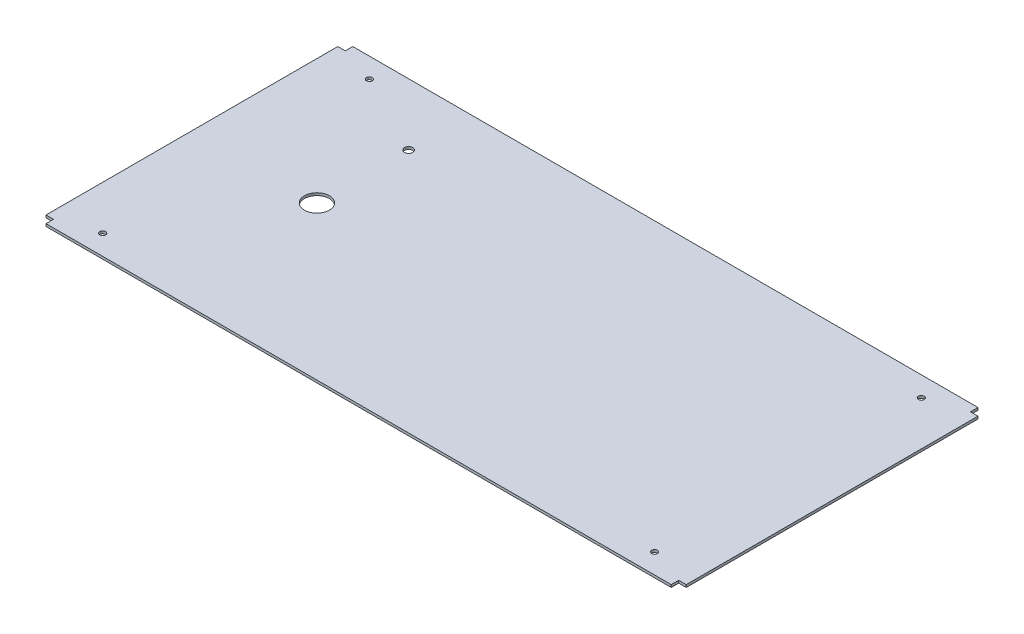
ISO-10303-21;
HEADER;
FILE_DESCRIPTION(('STEP AP214'),'2;1');
FILE_NAME('part.step','',(''),(''),'','','');
FILE_SCHEMA(('AUTOMOTIVE_DESIGN { 1 0 10303 214 1 1 1 1 }'));
ENDSEC;
DATA;
#1=APPLICATION_CONTEXT('core data for automotive mechanical design processes');
#2=APPLICATION_PROTOCOL_DEFINITION('international standard','automotive_design',2000,#1);
#3=PRODUCT_CONTEXT('',#1,'mechanical');
#4=PRODUCT('Part','Part','',(#3));
#5=PRODUCT_RELATED_PRODUCT_CATEGORY('part','',(#4));
#6=PRODUCT_DEFINITION_FORMATION('','',#4);
#7=PRODUCT_DEFINITION_CONTEXT('part definition',#1,'design');
#8=PRODUCT_DEFINITION('design','',#6,#7);
#9=PRODUCT_DEFINITION_SHAPE('','',#8);
#10=(LENGTH_UNIT() NAMED_UNIT(*) SI_UNIT(.MILLI.,.METRE.));
#11=(NAMED_UNIT(*) PLANE_ANGLE_UNIT() SI_UNIT($,.RADIAN.));
#12=(NAMED_UNIT(*) SI_UNIT($,.STERADIAN.) SOLID_ANGLE_UNIT());
#13=UNCERTAINTY_MEASURE_WITH_UNIT(LENGTH_MEASURE(1.E-05),#10,'distance_accuracy_value','');
#14=(GEOMETRIC_REPRESENTATION_CONTEXT(3) GLOBAL_UNCERTAINTY_ASSIGNED_CONTEXT((#13)) GLOBAL_UNIT_ASSIGNED_CONTEXT((#10,
#11,#12)) REPRESENTATION_CONTEXT('',''));
#15=CARTESIAN_POINT('',(0.,0.,0.));
#16=DIRECTION('',(0.,0.,1.));
#17=DIRECTION('',(1.,0.,0.));
#18=AXIS2_PLACEMENT_3D('',#15,#16,#17);
#19=CARTESIAN_POINT('',(0.,3.,0.));
#20=DIRECTION('',(0.,1.,0.));
#21=DIRECTION('',(0.,0.,1.));
#22=AXIS2_PLACEMENT_3D('',#19,#20,#21);
#23=PLANE('',#22);
#24=CARTESIAN_POINT('',(-234.,3.,-110.));
#25=DIRECTION('',(0.,1.,0.));
#26=DIRECTION('',(0.,0.,1.));
#27=AXIS2_PLACEMENT_3D('',#24,#25,#26);
#28=CIRCLE('',#27,5.00000000000002);
#29=CARTESIAN_POINT('',(-234.,3.,-105.));
#30=VERTEX_POINT('',#29);
#31=EDGE_CURVE('E301',#30,#30,#28,.T.);
#32=ORIENTED_EDGE('',*,*,#31,.F.);
#33=EDGE_LOOP('',(#32));
#34=FACE_BOUND('',#33,.T.);
#35=CARTESIAN_POINT('',(-234.,3.,0.));
#36=DIRECTION('',(0.,1.,0.));
#37=DIRECTION('',(0.,0.,1.));
#38=AXIS2_PLACEMENT_3D('',#35,#36,#37);
#39=CIRCLE('',#38,15.);
#40=CARTESIAN_POINT('',(-234.,3.,15.));
#41=VERTEX_POINT('',#40);
#42=EDGE_CURVE('E303',#41,#41,#39,.T.);
#43=ORIENTED_EDGE('',*,*,#42,.F.);
#44=EDGE_LOOP('',(#43));
#45=FACE_BOUND('',#44,.T.);
#46=CARTESIAN_POINT('',(331.06,3.,-160.));
#47=DIRECTION('',(0.,1.,0.));
#48=DIRECTION('',(0.,0.,1.));
#49=AXIS2_PLACEMENT_3D('',#46,#47,#48);
#50=CIRCLE('',#49,3.50000000000002);
#51=CARTESIAN_POINT('',(331.06,3.,-156.5));
#52=VERTEX_POINT('',#51);
#53=EDGE_CURVE('E318',#52,#52,#50,.T.);
#54=ORIENTED_EDGE('',*,*,#53,.F.);
#55=EDGE_LOOP('',(#54));
#56=FACE_BOUND('',#55,.T.);
#57=CARTESIAN_POINT('',(-331.06,3.,-160.));
#58=DIRECTION('',(0.,1.,0.));
#59=DIRECTION('',(0.,0.,1.));
#60=AXIS2_PLACEMENT_3D('',#57,#58,#59);
#61=CIRCLE('',#60,3.50000000000002);
#62=CARTESIAN_POINT('',(-331.06,3.,-156.5));
#63=VERTEX_POINT('',#62);
#64=EDGE_CURVE('E166',#63,#63,#61,.T.);
#65=ORIENTED_EDGE('',*,*,#64,.F.);
#66=EDGE_LOOP('',(#65));
#67=FACE_BOUND('',#66,.T.);
#68=DIRECTION('',(0.,0.,1.));
#69=VECTOR('',#68,1.);
#70=CARTESIAN_POINT('',(-375.,3.,-184.));
#71=LINE('',#70,#69);
#72=CARTESIAN_POINT('',(-375.,3.,-184.));
#73=VERTEX_POINT('',#72);
#74=CARTESIAN_POINT('',(-375.,3.,-175.));
#75=VERTEX_POINT('',#74);
#76=EDGE_CURVE('E185',#73,#75,#71,.T.);
#77=ORIENTED_EDGE('',*,*,#76,.T.);
#78=DIRECTION('',(-1.,0.,0.));
#79=VECTOR('',#78,1.);
#80=CARTESIAN_POINT('',(-384.,3.,-175.));
#81=LINE('',#80,#79);
#82=CARTESIAN_POINT('',(-384.,3.,-175.));
#83=VERTEX_POINT('',#82);
#84=EDGE_CURVE('E113',#75,#83,#81,.T.);
#85=ORIENTED_EDGE('',*,*,#84,.T.);
#86=DIRECTION('',(0.,0.,1.));
#87=VECTOR('',#86,1.);
#88=CARTESIAN_POINT('',(-384.,3.,-175.));
#89=LINE('',#88,#87);
#90=CARTESIAN_POINT('',(-384.,3.,175.));
#91=VERTEX_POINT('',#90);
#92=EDGE_CURVE('E212',#83,#91,#89,.T.);
#93=ORIENTED_EDGE('',*,*,#92,.T.);
#94=DIRECTION('',(1.,0.,0.));
#95=VECTOR('',#94,1.);
#96=CARTESIAN_POINT('',(-384.,3.,175.));
#97=LINE('',#96,#95);
#98=CARTESIAN_POINT('',(-375.,3.,175.));
#99=VERTEX_POINT('',#98);
#100=EDGE_CURVE('E231',#91,#99,#97,.T.);
#101=ORIENTED_EDGE('',*,*,#100,.T.);
#102=DIRECTION('',(0.,0.,1.));
#103=VECTOR('',#102,1.);
#104=CARTESIAN_POINT('',(-375.,3.,184.));
#105=LINE('',#104,#103);
#106=CARTESIAN_POINT('',(-375.,3.,184.));
#107=VERTEX_POINT('',#106);
#108=EDGE_CURVE('E228',#99,#107,#105,.T.);
#109=ORIENTED_EDGE('',*,*,#108,.T.);
#110=DIRECTION('',(1.,0.,0.));
#111=VECTOR('',#110,1.);
#112=CARTESIAN_POINT('',(-375.,3.,184.));
#113=LINE('',#112,#111);
#114=CARTESIAN_POINT('',(375.,3.,184.));
#115=VERTEX_POINT('',#114);
#116=EDGE_CURVE('E230',#107,#115,#113,.T.);
#117=ORIENTED_EDGE('',*,*,#116,.T.);
#118=DIRECTION('',(0.,0.,-1.));
#119=VECTOR('',#118,1.);
#120=CARTESIAN_POINT('',(375.,3.,184.));
#121=LINE('',#120,#119);
#122=CARTESIAN_POINT('',(375.,3.,175.));
#123=VERTEX_POINT('',#122);
#124=EDGE_CURVE('E233',#115,#123,#121,.T.);
#125=ORIENTED_EDGE('',*,*,#124,.T.);
#126=DIRECTION('',(1.,0.,0.));
#127=VECTOR('',#126,1.);
#128=CARTESIAN_POINT('',(384.,3.,175.));
#129=LINE('',#128,#127);
#130=CARTESIAN_POINT('',(384.,3.,175.));
#131=VERTEX_POINT('',#130);
#132=EDGE_CURVE('E239',#123,#131,#129,.T.);
#133=ORIENTED_EDGE('',*,*,#132,.T.);
#134=DIRECTION('',(0.,0.,-1.));
#135=VECTOR('',#134,1.);
#136=CARTESIAN_POINT('',(384.,3.,-175.));
#137=LINE('',#136,#135);
#138=CARTESIAN_POINT('',(384.,3.,-175.));
#139=VERTEX_POINT('',#138);
#140=EDGE_CURVE('E144',#131,#139,#137,.T.);
#141=ORIENTED_EDGE('',*,*,#140,.T.);
#142=DIRECTION('',(-1.,0.,0.));
#143=VECTOR('',#142,1.);
#144=CARTESIAN_POINT('',(384.,3.,-175.));
#145=LINE('',#144,#143);
#146=CARTESIAN_POINT('',(375.,3.,-175.));
#147=VERTEX_POINT('',#146);
#148=EDGE_CURVE('E138',#139,#147,#145,.T.);
#149=ORIENTED_EDGE('',*,*,#148,.T.);
#150=DIRECTION('',(0.,0.,-1.));
#151=VECTOR('',#150,1.);
#152=CARTESIAN_POINT('',(375.,3.,-184.));
#153=LINE('',#152,#151);
#154=CARTESIAN_POINT('',(375.,3.,-184.));
#155=VERTEX_POINT('',#154);
#156=EDGE_CURVE('E142',#147,#155,#153,.T.);
#157=ORIENTED_EDGE('',*,*,#156,.T.);
#158=DIRECTION('',(-1.,0.,0.));
#159=VECTOR('',#158,1.);
#160=CARTESIAN_POINT('',(-375.,3.,-184.));
#161=LINE('',#160,#159);
#162=EDGE_CURVE('E58',#155,#73,#161,.T.);
#163=ORIENTED_EDGE('',*,*,#162,.T.);
#164=EDGE_LOOP('',(#77,#85,#93,#101,#109,#117,#125,#133,#141,#149,#157,#163));
#165=FACE_BOUND('',#164,.T.);
#166=CARTESIAN_POINT('',(-331.06,3.,160.));
#167=DIRECTION('',(0.,1.,0.));
#168=DIRECTION('',(0.,0.,1.));
#169=AXIS2_PLACEMENT_3D('',#166,#167,#168);
#170=CIRCLE('',#169,3.50000000000002);
#171=CARTESIAN_POINT('',(-331.06,3.,163.5));
#172=VERTEX_POINT('',#171);
#173=EDGE_CURVE('E324',#172,#172,#170,.T.);
#174=ORIENTED_EDGE('',*,*,#173,.F.);
#175=EDGE_LOOP('',(#174));
#176=FACE_BOUND('',#175,.T.);
#177=CARTESIAN_POINT('',(331.06,3.,160.));
#178=DIRECTION('',(0.,1.,0.));
#179=DIRECTION('',(0.,0.,1.));
#180=AXIS2_PLACEMENT_3D('',#177,#178,#179);
#181=CIRCLE('',#180,3.50000000000002);
#182=CARTESIAN_POINT('',(331.06,3.,163.5));
#183=VERTEX_POINT('',#182);
#184=EDGE_CURVE('E312',#183,#183,#181,.T.);
#185=ORIENTED_EDGE('',*,*,#184,.F.);
#186=EDGE_LOOP('',(#185));
#187=FACE_BOUND('',#186,.T.);
#188=ADVANCED_FACE('F41',(#34,#45,#56,#67,#165,#176,#187),#23,.T.);
#189=CARTESIAN_POINT('',(0.,0.,0.));
#190=DIRECTION('',(0.,1.,0.));
#191=DIRECTION('',(0.,0.,1.));
#192=AXIS2_PLACEMENT_3D('',#189,#190,#191);
#193=PLANE('',#192);
#194=CARTESIAN_POINT('',(-234.,0.,-110.));
#195=DIRECTION('',(0.,1.,0.));
#196=DIRECTION('',(0.,0.,1.));
#197=AXIS2_PLACEMENT_3D('',#194,#195,#196);
#198=CIRCLE('',#197,5.00000000000002);
#199=CARTESIAN_POINT('',(-234.,0.,-105.));
#200=VERTEX_POINT('',#199);
#201=EDGE_CURVE('E299',#200,#200,#198,.T.);
#202=ORIENTED_EDGE('',*,*,#201,.T.);
#203=EDGE_LOOP('',(#202));
#204=FACE_BOUND('',#203,.T.);
#205=CARTESIAN_POINT('',(-234.,0.,0.));
#206=DIRECTION('',(0.,1.,0.));
#207=DIRECTION('',(0.,0.,1.));
#208=AXIS2_PLACEMENT_3D('',#205,#206,#207);
#209=CIRCLE('',#208,15.);
#210=CARTESIAN_POINT('',(-234.,0.,15.));
#211=VERTEX_POINT('',#210);
#212=EDGE_CURVE('E306',#211,#211,#209,.T.);
#213=ORIENTED_EDGE('',*,*,#212,.T.);
#214=EDGE_LOOP('',(#213));
#215=FACE_BOUND('',#214,.T.);
#216=DIRECTION('',(0.,0.,1.));
#217=VECTOR('',#216,1.);
#218=CARTESIAN_POINT('',(-375.,0.,-184.));
#219=LINE('',#218,#217);
#220=CARTESIAN_POINT('',(-375.,0.,-184.));
#221=VERTEX_POINT('',#220);
#222=CARTESIAN_POINT('',(-375.,0.,-175.));
#223=VERTEX_POINT('',#222);
#224=EDGE_CURVE('E162',#221,#223,#219,.T.);
#225=ORIENTED_EDGE('',*,*,#224,.F.);
#226=DIRECTION('',(-1.,0.,0.));
#227=VECTOR('',#226,1.);
#228=CARTESIAN_POINT('',(-375.,0.,-184.));
#229=LINE('',#228,#227);
#230=CARTESIAN_POINT('',(375.,0.,-184.));
#231=VERTEX_POINT('',#230);
#232=EDGE_CURVE('E105',#231,#221,#229,.T.);
#233=ORIENTED_EDGE('',*,*,#232,.F.);
#234=DIRECTION('',(0.,0.,-1.));
#235=VECTOR('',#234,1.);
#236=CARTESIAN_POINT('',(375.,0.,-184.));
#237=LINE('',#236,#235);
#238=CARTESIAN_POINT('',(375.,0.,-175.));
#239=VERTEX_POINT('',#238);
#240=EDGE_CURVE('E99',#239,#231,#237,.T.);
#241=ORIENTED_EDGE('',*,*,#240,.F.);
#242=DIRECTION('',(-1.,0.,0.));
#243=VECTOR('',#242,1.);
#244=CARTESIAN_POINT('',(384.,0.,-175.));
#245=LINE('',#244,#243);
#246=CARTESIAN_POINT('',(384.,0.,-175.));
#247=VERTEX_POINT('',#246);
#248=EDGE_CURVE('E152',#247,#239,#245,.T.);
#249=ORIENTED_EDGE('',*,*,#248,.F.);
#250=DIRECTION('',(0.,0.,-1.));
#251=VECTOR('',#250,1.);
#252=CARTESIAN_POINT('',(384.,0.,-175.));
#253=LINE('',#252,#251);
#254=CARTESIAN_POINT('',(384.,0.,175.));
#255=VERTEX_POINT('',#254);
#256=EDGE_CURVE('E180',#255,#247,#253,.T.);
#257=ORIENTED_EDGE('',*,*,#256,.F.);
#258=DIRECTION('',(1.,0.,0.));
#259=VECTOR('',#258,1.);
#260=CARTESIAN_POINT('',(384.,0.,175.));
#261=LINE('',#260,#259);
#262=CARTESIAN_POINT('',(375.,0.,175.));
#263=VERTEX_POINT('',#262);
#264=EDGE_CURVE('E178',#263,#255,#261,.T.);
#265=ORIENTED_EDGE('',*,*,#264,.F.);
#266=DIRECTION('',(0.,0.,-1.));
#267=VECTOR('',#266,1.);
#268=CARTESIAN_POINT('',(375.,0.,184.));
#269=LINE('',#268,#267);
#270=CARTESIAN_POINT('',(375.,0.,184.));
#271=VERTEX_POINT('',#270);
#272=EDGE_CURVE('E176',#271,#263,#269,.T.);
#273=ORIENTED_EDGE('',*,*,#272,.F.);
#274=DIRECTION('',(1.,0.,0.));
#275=VECTOR('',#274,1.);
#276=CARTESIAN_POINT('',(-375.,0.,184.));
#277=LINE('',#276,#275);
#278=CARTESIAN_POINT('',(-375.,0.,184.));
#279=VERTEX_POINT('',#278);
#280=EDGE_CURVE('E174',#279,#271,#277,.T.);
#281=ORIENTED_EDGE('',*,*,#280,.F.);
#282=DIRECTION('',(0.,0.,1.));
#283=VECTOR('',#282,1.);
#284=CARTESIAN_POINT('',(-375.,0.,184.));
#285=LINE('',#284,#283);
#286=CARTESIAN_POINT('',(-375.,0.,175.));
#287=VERTEX_POINT('',#286);
#288=EDGE_CURVE('E172',#287,#279,#285,.T.);
#289=ORIENTED_EDGE('',*,*,#288,.F.);
#290=DIRECTION('',(1.,0.,0.));
#291=VECTOR('',#290,1.);
#292=CARTESIAN_POINT('',(-384.,0.,175.));
#293=LINE('',#292,#291);
#294=CARTESIAN_POINT('',(-384.,0.,175.));
#295=VERTEX_POINT('',#294);
#296=EDGE_CURVE('E170',#295,#287,#293,.T.);
#297=ORIENTED_EDGE('',*,*,#296,.F.);
#298=DIRECTION('',(0.,0.,1.));
#299=VECTOR('',#298,1.);
#300=CARTESIAN_POINT('',(-384.,0.,-175.));
#301=LINE('',#300,#299);
#302=CARTESIAN_POINT('',(-384.,0.,-175.));
#303=VERTEX_POINT('',#302);
#304=EDGE_CURVE('E168',#303,#295,#301,.T.);
#305=ORIENTED_EDGE('',*,*,#304,.F.);
#306=DIRECTION('',(-1.,0.,0.));
#307=VECTOR('',#306,1.);
#308=CARTESIAN_POINT('',(-384.,0.,-175.));
#309=LINE('',#308,#307);
#310=EDGE_CURVE('E165',#223,#303,#309,.T.);
#311=ORIENTED_EDGE('',*,*,#310,.F.);
#312=EDGE_LOOP('',(#225,#233,#241,#249,#257,#265,#273,#281,#289,#297,#305,#311));
#313=FACE_BOUND('',#312,.T.);
#314=CARTESIAN_POINT('',(-331.06,0.,-160.));
#315=DIRECTION('',(0.,1.,0.));
#316=DIRECTION('',(0.,0.,1.));
#317=AXIS2_PLACEMENT_3D('',#314,#315,#316);
#318=CIRCLE('',#317,3.50000000000002);
#319=CARTESIAN_POINT('',(-331.06,0.,-156.5));
#320=VERTEX_POINT('',#319);
#321=EDGE_CURVE('E327',#320,#320,#318,.T.);
#322=ORIENTED_EDGE('',*,*,#321,.T.);
#323=EDGE_LOOP('',(#322));
#324=FACE_BOUND('',#323,.T.);
#325=CARTESIAN_POINT('',(-331.06,0.,160.));
#326=DIRECTION('',(0.,1.,0.));
#327=DIRECTION('',(0.,0.,1.));
#328=AXIS2_PLACEMENT_3D('',#325,#326,#327);
#329=CIRCLE('',#328,3.50000000000002);
#330=CARTESIAN_POINT('',(-331.06,0.,163.5));
#331=VERTEX_POINT('',#330);
#332=EDGE_CURVE('E321',#331,#331,#329,.T.);
#333=ORIENTED_EDGE('',*,*,#332,.T.);
#334=EDGE_LOOP('',(#333));
#335=FACE_BOUND('',#334,.T.);
#336=CARTESIAN_POINT('',(331.06,0.,-160.));
#337=DIRECTION('',(0.,1.,0.));
#338=DIRECTION('',(0.,0.,1.));
#339=AXIS2_PLACEMENT_3D('',#336,#337,#338);
#340=CIRCLE('',#339,3.50000000000002);
#341=CARTESIAN_POINT('',(331.06,0.,-156.5));
#342=VERTEX_POINT('',#341);
#343=EDGE_CURVE('E315',#342,#342,#340,.T.);
#344=ORIENTED_EDGE('',*,*,#343,.T.);
#345=EDGE_LOOP('',(#344));
#346=FACE_BOUND('',#345,.T.);
#347=CARTESIAN_POINT('',(331.06,0.,160.));
#348=DIRECTION('',(0.,1.,0.));
#349=DIRECTION('',(0.,0.,1.));
#350=AXIS2_PLACEMENT_3D('',#347,#348,#349);
#351=CIRCLE('',#350,3.50000000000002);
#352=CARTESIAN_POINT('',(331.06,0.,163.5));
#353=VERTEX_POINT('',#352);
#354=EDGE_CURVE('E309',#353,#353,#351,.T.);
#355=ORIENTED_EDGE('',*,*,#354,.T.);
#356=EDGE_LOOP('',(#355));
#357=FACE_BOUND('',#356,.T.);
#358=ADVANCED_FACE('F216',(#204,#215,#313,#324,#335,#346,#357),#193,.F.);
#359=CARTESIAN_POINT('',(-375.,3.,-184.));
#360=DIRECTION('',(1.,0.,0.));
#361=DIRECTION('',(0.,0.,-1.));
#362=AXIS2_PLACEMENT_3D('',#359,#360,#361);
#363=PLANE('',#362);
#364=ORIENTED_EDGE('',*,*,#224,.T.);
#365=DIRECTION('',(0.,-1.,0.));
#366=VECTOR('',#365,1.);
#367=CARTESIAN_POINT('',(-375.,3.,-175.));
#368=LINE('',#367,#366);
#369=EDGE_CURVE('E11',#75,#223,#368,.T.);
#370=ORIENTED_EDGE('',*,*,#369,.F.);
#371=ORIENTED_EDGE('',*,*,#76,.F.);
#372=DIRECTION('',(0.,-1.,0.));
#373=VECTOR('',#372,1.);
#374=CARTESIAN_POINT('',(-375.,3.,-184.));
#375=LINE('',#374,#373);
#376=EDGE_CURVE('E158',#73,#221,#375,.T.);
#377=ORIENTED_EDGE('',*,*,#376,.T.);
#378=EDGE_LOOP('',(#364,#370,#371,#377));
#379=FACE_BOUND('',#378,.T.);
#380=ADVANCED_FACE('F43',(#379),#363,.F.);
#381=CARTESIAN_POINT('',(-384.,3.,-175.));
#382=DIRECTION('',(0.,0.,1.));
#383=DIRECTION('',(1.,0.,0.));
#384=AXIS2_PLACEMENT_3D('',#381,#382,#383);
#385=PLANE('',#384);
#386=ORIENTED_EDGE('',*,*,#310,.T.);
#387=DIRECTION('',(0.,-1.,0.));
#388=VECTOR('',#387,1.);
#389=CARTESIAN_POINT('',(-384.,3.,-175.));
#390=LINE('',#389,#388);
#391=EDGE_CURVE('E50',#83,#303,#390,.T.);
#392=ORIENTED_EDGE('',*,*,#391,.F.);
#393=ORIENTED_EDGE('',*,*,#84,.F.);
#394=ORIENTED_EDGE('',*,*,#369,.T.);
#395=EDGE_LOOP('',(#386,#392,#393,#394));
#396=FACE_BOUND('',#395,.T.);
#397=ADVANCED_FACE('F376',(#396),#385,.F.);
#398=CARTESIAN_POINT('',(-384.,3.,-175.));
#399=DIRECTION('',(1.,0.,0.));
#400=DIRECTION('',(0.,0.,-1.));
#401=AXIS2_PLACEMENT_3D('',#398,#399,#400);
#402=PLANE('',#401);
#403=ORIENTED_EDGE('',*,*,#304,.T.);
#404=DIRECTION('',(0.,-1.,0.));
#405=VECTOR('',#404,1.);
#406=CARTESIAN_POINT('',(-384.,3.,175.));
#407=LINE('',#406,#405);
#408=EDGE_CURVE('E204',#91,#295,#407,.T.);
#409=ORIENTED_EDGE('',*,*,#408,.F.);
#410=ORIENTED_EDGE('',*,*,#92,.F.);
#411=ORIENTED_EDGE('',*,*,#391,.T.);
#412=EDGE_LOOP('',(#403,#409,#410,#411));
#413=FACE_BOUND('',#412,.T.);
#414=ADVANCED_FACE('F210',(#413),#402,.F.);
#415=CARTESIAN_POINT('',(-384.,3.,175.));
#416=DIRECTION('',(0.,0.,-1.));
#417=DIRECTION('',(-1.,0.,0.));
#418=AXIS2_PLACEMENT_3D('',#415,#416,#417);
#419=PLANE('',#418);
#420=ORIENTED_EDGE('',*,*,#296,.T.);
#421=DIRECTION('',(0.,-1.,0.));
#422=VECTOR('',#421,1.);
#423=CARTESIAN_POINT('',(-375.,3.,175.));
#424=LINE('',#423,#422);
#425=EDGE_CURVE('E201',#99,#287,#424,.T.);
#426=ORIENTED_EDGE('',*,*,#425,.F.);
#427=ORIENTED_EDGE('',*,*,#100,.F.);
#428=ORIENTED_EDGE('',*,*,#408,.T.);
#429=EDGE_LOOP('',(#420,#426,#427,#428));
#430=FACE_BOUND('',#429,.T.);
#431=ADVANCED_FACE('F222',(#430),#419,.F.);
#432=CARTESIAN_POINT('',(-375.,3.,184.));
#433=DIRECTION('',(1.,0.,0.));
#434=DIRECTION('',(0.,0.,-1.));
#435=AXIS2_PLACEMENT_3D('',#432,#433,#434);
#436=PLANE('',#435);
#437=ORIENTED_EDGE('',*,*,#288,.T.);
#438=DIRECTION('',(0.,-1.,0.));
#439=VECTOR('',#438,1.);
#440=CARTESIAN_POINT('',(-375.,3.,184.));
#441=LINE('',#440,#439);
#442=EDGE_CURVE('E198',#107,#279,#441,.T.);
#443=ORIENTED_EDGE('',*,*,#442,.F.);
#444=ORIENTED_EDGE('',*,*,#108,.F.);
#445=ORIENTED_EDGE('',*,*,#425,.T.);
#446=EDGE_LOOP('',(#437,#443,#444,#445));
#447=FACE_BOUND('',#446,.T.);
#448=ADVANCED_FACE('F226',(#447),#436,.F.);
#449=CARTESIAN_POINT('',(-375.,3.,184.));
#450=DIRECTION('',(0.,0.,-1.));
#451=DIRECTION('',(-1.,0.,0.));
#452=AXIS2_PLACEMENT_3D('',#449,#450,#451);
#453=PLANE('',#452);
#454=ORIENTED_EDGE('',*,*,#280,.T.);
#455=DIRECTION('',(0.,-1.,0.));
#456=VECTOR('',#455,1.);
#457=CARTESIAN_POINT('',(375.,3.,184.));
#458=LINE('',#457,#456);
#459=EDGE_CURVE('E195',#115,#271,#458,.T.);
#460=ORIENTED_EDGE('',*,*,#459,.F.);
#461=ORIENTED_EDGE('',*,*,#116,.F.);
#462=ORIENTED_EDGE('',*,*,#442,.T.);
#463=EDGE_LOOP('',(#454,#460,#461,#462));
#464=FACE_BOUND('',#463,.T.);
#465=ADVANCED_FACE('F407',(#464),#453,.F.);
#466=CARTESIAN_POINT('',(375.,3.,184.));
#467=DIRECTION('',(-1.,0.,0.));
#468=DIRECTION('',(0.,0.,1.));
#469=AXIS2_PLACEMENT_3D('',#466,#467,#468);
#470=PLANE('',#469);
#471=ORIENTED_EDGE('',*,*,#272,.T.);
#472=DIRECTION('',(0.,-1.,0.));
#473=VECTOR('',#472,1.);
#474=CARTESIAN_POINT('',(375.,3.,175.));
#475=LINE('',#474,#473);
#476=EDGE_CURVE('E192',#123,#263,#475,.T.);
#477=ORIENTED_EDGE('',*,*,#476,.F.);
#478=ORIENTED_EDGE('',*,*,#124,.F.);
#479=ORIENTED_EDGE('',*,*,#459,.T.);
#480=EDGE_LOOP('',(#471,#477,#478,#479));
#481=FACE_BOUND('',#480,.T.);
#482=ADVANCED_FACE('F416',(#481),#470,.F.);
#483=CARTESIAN_POINT('',(384.,3.,175.));
#484=DIRECTION('',(0.,0.,-1.));
#485=DIRECTION('',(-1.,0.,0.));
#486=AXIS2_PLACEMENT_3D('',#483,#484,#485);
#487=PLANE('',#486);
#488=ORIENTED_EDGE('',*,*,#264,.T.);
#489=DIRECTION('',(0.,-1.,0.));
#490=VECTOR('',#489,1.);
#491=CARTESIAN_POINT('',(384.,3.,175.));
#492=LINE('',#491,#490);
#493=EDGE_CURVE('E189',#131,#255,#492,.T.);
#494=ORIENTED_EDGE('',*,*,#493,.F.);
#495=ORIENTED_EDGE('',*,*,#132,.F.);
#496=ORIENTED_EDGE('',*,*,#476,.T.);
#497=EDGE_LOOP('',(#488,#494,#495,#496));
#498=FACE_BOUND('',#497,.T.);
#499=ADVANCED_FACE('F245',(#498),#487,.F.);
#500=CARTESIAN_POINT('',(384.,3.,-175.));
#501=DIRECTION('',(-1.,0.,0.));
#502=DIRECTION('',(0.,0.,1.));
#503=AXIS2_PLACEMENT_3D('',#500,#501,#502);
#504=PLANE('',#503);
#505=ORIENTED_EDGE('',*,*,#256,.T.);
#506=DIRECTION('',(0.,-1.,0.));
#507=VECTOR('',#506,1.);
#508=CARTESIAN_POINT('',(384.,3.,-175.));
#509=LINE('',#508,#507);
#510=EDGE_CURVE('E153',#139,#247,#509,.T.);
#511=ORIENTED_EDGE('',*,*,#510,.F.);
#512=ORIENTED_EDGE('',*,*,#140,.F.);
#513=ORIENTED_EDGE('',*,*,#493,.T.);
#514=EDGE_LOOP('',(#505,#511,#512,#513));
#515=FACE_BOUND('',#514,.T.);
#516=ADVANCED_FACE('F249',(#515),#504,.F.);
#517=CARTESIAN_POINT('',(384.,3.,-175.));
#518=DIRECTION('',(0.,0.,1.));
#519=DIRECTION('',(1.,0.,0.));
#520=AXIS2_PLACEMENT_3D('',#517,#518,#519);
#521=PLANE('',#520);
#522=ORIENTED_EDGE('',*,*,#248,.T.);
#523=DIRECTION('',(0.,-1.,0.));
#524=VECTOR('',#523,1.);
#525=CARTESIAN_POINT('',(375.,3.,-175.));
#526=LINE('',#525,#524);
#527=EDGE_CURVE('E149',#147,#239,#526,.T.);
#528=ORIENTED_EDGE('',*,*,#527,.F.);
#529=ORIENTED_EDGE('',*,*,#148,.F.);
#530=ORIENTED_EDGE('',*,*,#510,.T.);
#531=EDGE_LOOP('',(#522,#528,#529,#530));
#532=FACE_BOUND('',#531,.T.);
#533=ADVANCED_FACE('F150',(#532),#521,.F.);
#534=CARTESIAN_POINT('',(375.,3.,-184.));
#535=DIRECTION('',(-1.,0.,0.));
#536=DIRECTION('',(0.,0.,1.));
#537=AXIS2_PLACEMENT_3D('',#534,#535,#536);
#538=PLANE('',#537);
#539=ORIENTED_EDGE('',*,*,#240,.T.);
#540=DIRECTION('',(0.,-1.,0.));
#541=VECTOR('',#540,1.);
#542=CARTESIAN_POINT('',(375.,3.,-184.));
#543=LINE('',#542,#541);
#544=EDGE_CURVE('E154',#155,#231,#543,.T.);
#545=ORIENTED_EDGE('',*,*,#544,.F.);
#546=ORIENTED_EDGE('',*,*,#156,.F.);
#547=ORIENTED_EDGE('',*,*,#527,.T.);
#548=EDGE_LOOP('',(#539,#545,#546,#547));
#549=FACE_BOUND('',#548,.T.);
#550=ADVANCED_FACE('F156',(#549),#538,.F.);
#551=CARTESIAN_POINT('',(-375.,3.,-184.));
#552=DIRECTION('',(0.,0.,1.));
#553=DIRECTION('',(1.,0.,0.));
#554=AXIS2_PLACEMENT_3D('',#551,#552,#553);
#555=PLANE('',#554);
#556=ORIENTED_EDGE('',*,*,#232,.T.);
#557=ORIENTED_EDGE('',*,*,#376,.F.);
#558=ORIENTED_EDGE('',*,*,#162,.F.);
#559=ORIENTED_EDGE('',*,*,#544,.T.);
#560=EDGE_LOOP('',(#556,#557,#558,#559));
#561=FACE_BOUND('',#560,.T.);
#562=ADVANCED_FACE('F253',(#561),#555,.F.);
#563=CARTESIAN_POINT('',(-331.06,3.,-160.));
#564=DIRECTION('',(0.,-1.,0.));
#565=DIRECTION('',(0.,0.,-1.));
#566=AXIS2_PLACEMENT_3D('',#563,#564,#565);
#567=CYLINDRICAL_SURFACE('',#566,3.50000000000002);
#568=ORIENTED_EDGE('',*,*,#64,.T.);
#569=EDGE_LOOP('',(#568));
#570=FACE_BOUND('',#569,.T.);
#571=ORIENTED_EDGE('',*,*,#321,.F.);
#572=EDGE_LOOP('',(#571));
#573=FACE_BOUND('',#572,.T.);
#574=ADVANCED_FACE('F255',(#570,#573),#567,.F.);
#575=CARTESIAN_POINT('',(-331.06,3.,160.));
#576=DIRECTION('',(0.,-1.,0.));
#577=DIRECTION('',(0.,0.,-1.));
#578=AXIS2_PLACEMENT_3D('',#575,#576,#577);
#579=CYLINDRICAL_SURFACE('',#578,3.50000000000002);
#580=ORIENTED_EDGE('',*,*,#173,.T.);
#581=EDGE_LOOP('',(#580));
#582=FACE_BOUND('',#581,.T.);
#583=ORIENTED_EDGE('',*,*,#332,.F.);
#584=EDGE_LOOP('',(#583));
#585=FACE_BOUND('',#584,.T.);
#586=ADVANCED_FACE('F261',(#582,#585),#579,.F.);
#587=CARTESIAN_POINT('',(331.06,3.,-160.));
#588=DIRECTION('',(0.,-1.,0.));
#589=DIRECTION('',(0.,0.,-1.));
#590=AXIS2_PLACEMENT_3D('',#587,#588,#589);
#591=CYLINDRICAL_SURFACE('',#590,3.50000000000002);
#592=ORIENTED_EDGE('',*,*,#53,.T.);
#593=EDGE_LOOP('',(#592));
#594=FACE_BOUND('',#593,.T.);
#595=ORIENTED_EDGE('',*,*,#343,.F.);
#596=EDGE_LOOP('',(#595));
#597=FACE_BOUND('',#596,.T.);
#598=ADVANCED_FACE('F279',(#594,#597),#591,.F.);
#599=CARTESIAN_POINT('',(331.06,3.,160.));
#600=DIRECTION('',(0.,-1.,0.));
#601=DIRECTION('',(0.,0.,-1.));
#602=AXIS2_PLACEMENT_3D('',#599,#600,#601);
#603=CYLINDRICAL_SURFACE('',#602,3.50000000000002);
#604=ORIENTED_EDGE('',*,*,#184,.T.);
#605=EDGE_LOOP('',(#604));
#606=FACE_BOUND('',#605,.T.);
#607=ORIENTED_EDGE('',*,*,#354,.F.);
#608=EDGE_LOOP('',(#607));
#609=FACE_BOUND('',#608,.T.);
#610=ADVANCED_FACE('F283',(#606,#609),#603,.F.);
#611=CARTESIAN_POINT('',(-234.,0.,0.));
#612=DIRECTION('',(0.,1.,0.));
#613=DIRECTION('',(0.,0.,1.));
#614=AXIS2_PLACEMENT_3D('',#611,#612,#613);
#615=CYLINDRICAL_SURFACE('',#614,15.);
#616=ORIENTED_EDGE('',*,*,#212,.F.);
#617=EDGE_LOOP('',(#616));
#618=FACE_BOUND('',#617,.T.);
#619=ORIENTED_EDGE('',*,*,#42,.T.);
#620=EDGE_LOOP('',(#619));
#621=FACE_BOUND('',#620,.T.);
#622=ADVANCED_FACE('F287',(#618,#621),#615,.F.);
#623=CARTESIAN_POINT('',(-234.,0.,-110.));
#624=DIRECTION('',(0.,1.,0.));
#625=DIRECTION('',(0.,0.,1.));
#626=AXIS2_PLACEMENT_3D('',#623,#624,#625);
#627=CYLINDRICAL_SURFACE('',#626,5.00000000000002);
#628=ORIENTED_EDGE('',*,*,#201,.F.);
#629=EDGE_LOOP('',(#628));
#630=FACE_BOUND('',#629,.T.);
#631=ORIENTED_EDGE('',*,*,#31,.T.);
#632=EDGE_LOOP('',(#631));
#633=FACE_BOUND('',#632,.T.);
#634=ADVANCED_FACE('F290',(#630,#633),#627,.F.);
#635=CLOSED_SHELL('',(#188,#358,#380,#397,#414,#431,#448,#465,#482,#499,#516,#533,#550,#562,
#574,#586,#598,#610,#622,#634));
#636=MANIFOLD_SOLID_BREP('B2',#635);
#637=ADVANCED_BREP_SHAPE_REPRESENTATION('',(#18,#636),#14);
#638=SHAPE_DEFINITION_REPRESENTATION(#9,#637);
ENDSEC;
END-ISO-10303-21;
